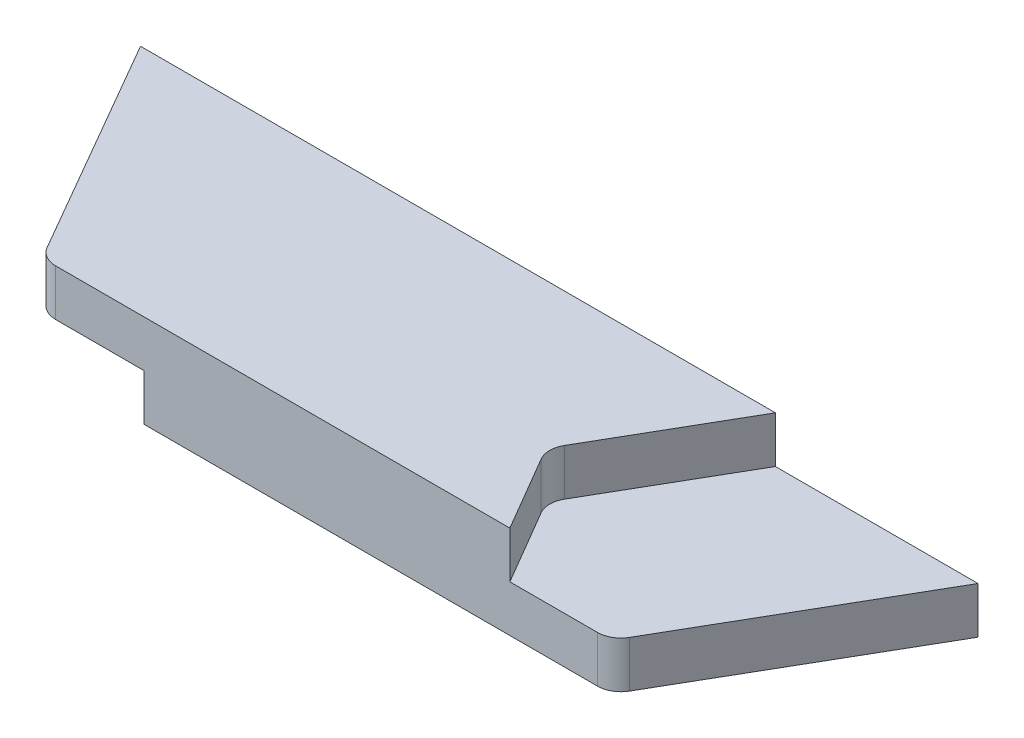
ISO-10303-21;
HEADER;
FILE_DESCRIPTION(('STEP AP214'),'2;1');
FILE_NAME('part.step','',(''),(''),'','','');
FILE_SCHEMA(('AUTOMOTIVE_DESIGN { 1 0 10303 214 1 1 1 1 }'));
ENDSEC;
DATA;
#1=APPLICATION_CONTEXT('core data for automotive mechanical design processes');
#2=APPLICATION_PROTOCOL_DEFINITION('international standard','automotive_design',2000,#1);
#3=PRODUCT_CONTEXT('',#1,'mechanical');
#4=PRODUCT('Part','Part','',(#3));
#5=PRODUCT_RELATED_PRODUCT_CATEGORY('part','',(#4));
#6=PRODUCT_DEFINITION_FORMATION('','',#4);
#7=PRODUCT_DEFINITION_CONTEXT('part definition',#1,'design');
#8=PRODUCT_DEFINITION('design','',#6,#7);
#9=PRODUCT_DEFINITION_SHAPE('','',#8);
#10=(LENGTH_UNIT() NAMED_UNIT(*) SI_UNIT(.MILLI.,.METRE.));
#11=(NAMED_UNIT(*) PLANE_ANGLE_UNIT() SI_UNIT($,.RADIAN.));
#12=(NAMED_UNIT(*) SI_UNIT($,.STERADIAN.) SOLID_ANGLE_UNIT());
#13=UNCERTAINTY_MEASURE_WITH_UNIT(LENGTH_MEASURE(1.E-05),#10,'distance_accuracy_value','');
#14=(GEOMETRIC_REPRESENTATION_CONTEXT(3) GLOBAL_UNCERTAINTY_ASSIGNED_CONTEXT((#13)) GLOBAL_UNIT_ASSIGNED_CONTEXT((#10,
#11,#12)) REPRESENTATION_CONTEXT('',''));
#15=CARTESIAN_POINT('',(0.,0.,0.));
#16=DIRECTION('',(0.,0.,1.));
#17=DIRECTION('',(1.,0.,0.));
#18=AXIS2_PLACEMENT_3D('',#15,#16,#17);
#19=CARTESIAN_POINT('',(180.,0.,0.));
#20=DIRECTION('',(0.,0.,-1.));
#21=DIRECTION('',(-1.,0.,0.));
#22=AXIS2_PLACEMENT_3D('',#19,#20,#21);
#23=PLANE('',#22);
#24=DIRECTION('',(-1.,0.,0.));
#25=VECTOR('',#24,1.);
#26=CARTESIAN_POINT('',(180.,0.,0.));
#27=LINE('',#26,#25);
#28=CARTESIAN_POINT('',(148.24573519457,0.,0.));
#29=VERTEX_POINT('',#28);
#30=CARTESIAN_POINT('',(50.6989823595867,0.,0.));
#31=VERTEX_POINT('',#30);
#32=EDGE_CURVE('E137',#29,#31,#27,.T.);
#33=ORIENTED_EDGE('',*,*,#32,.F.);
#34=DIRECTION('',(0.,1.,0.));
#35=VECTOR('',#34,1.);
#36=CARTESIAN_POINT('',(148.24573519457,0.,0.));
#37=LINE('',#36,#35);
#38=CARTESIAN_POINT('',(148.24573519457,10.,0.));
#39=VERTEX_POINT('',#38);
#40=EDGE_CURVE('E162',#29,#39,#37,.T.);
#41=ORIENTED_EDGE('',*,*,#40,.T.);
#42=DIRECTION('',(1.,0.,0.));
#43=VECTOR('',#42,1.);
#44=CARTESIAN_POINT('',(180.,10.,0.));
#45=LINE('',#44,#43);
#46=CARTESIAN_POINT('',(129.384239063704,10.,0.));
#47=VERTEX_POINT('',#46);
#48=EDGE_CURVE('E157',#47,#39,#45,.T.);
#49=ORIENTED_EDGE('',*,*,#48,.F.);
#50=DIRECTION('',(0.,1.,0.));
#51=VECTOR('',#50,1.);
#52=CARTESIAN_POINT('',(129.384239063704,10.,0.));
#53=LINE('',#52,#51);
#54=CARTESIAN_POINT('',(129.384239063704,20.,0.));
#55=VERTEX_POINT('',#54);
#56=EDGE_CURVE('E195',#47,#55,#53,.T.);
#57=ORIENTED_EDGE('',*,*,#56,.T.);
#58=DIRECTION('',(-1.,0.,0.));
#59=VECTOR('',#58,1.);
#60=CARTESIAN_POINT('',(180.,20.,0.));
#61=LINE('',#60,#59);
#62=CARTESIAN_POINT('',(31.7542648054294,20.,0.));
#63=VERTEX_POINT('',#62);
#64=EDGE_CURVE('E128',#55,#63,#61,.T.);
#65=ORIENTED_EDGE('',*,*,#64,.T.);
#66=DIRECTION('',(0.,1.,0.));
#67=VECTOR('',#66,1.);
#68=CARTESIAN_POINT('',(31.7542648054294,0.,0.));
#69=LINE('',#68,#67);
#70=CARTESIAN_POINT('',(31.7542648054294,10.,0.));
#71=VERTEX_POINT('',#70);
#72=EDGE_CURVE('E171',#71,#63,#69,.T.);
#73=ORIENTED_EDGE('',*,*,#72,.F.);
#74=DIRECTION('',(-1.,0.,0.));
#75=VECTOR('',#74,1.);
#76=CARTESIAN_POINT('',(0.,10.,0.));
#77=LINE('',#76,#75);
#78=CARTESIAN_POINT('',(50.6989823595867,10.,0.));
#79=VERTEX_POINT('',#78);
#80=EDGE_CURVE('E112',#79,#71,#77,.T.);
#81=ORIENTED_EDGE('',*,*,#80,.F.);
#82=DIRECTION('',(0.,-1.,0.));
#83=VECTOR('',#82,1.);
#84=CARTESIAN_POINT('',(50.6989823595867,10.,0.));
#85=LINE('',#84,#83);
#86=EDGE_CURVE('E82',#79,#31,#85,.T.);
#87=ORIENTED_EDGE('',*,*,#86,.T.);
#88=EDGE_LOOP('',(#33,#41,#49,#57,#65,#73,#81,#87));
#89=FACE_BOUND('',#88,.T.);
#90=ADVANCED_FACE('F35',(#89),#23,.F.);
#91=CARTESIAN_POINT('',(180.,0.,0.));
#92=DIRECTION('',(0.,1.,0.));
#93=DIRECTION('',(0.,0.,1.));
#94=AXIS2_PLACEMENT_3D('',#91,#92,#93);
#95=PLANE('',#94);
#96=DIRECTION('',(0.500000000000004,0.,-0.866025403784436));
#97=VECTOR('',#96,1.);
#98=CARTESIAN_POINT('',(180.,0.,-50.));
#99=LINE('',#98,#97);
#100=CARTESIAN_POINT('',(152.575862213492,0.,-2.49999999999999));
#101=VERTEX_POINT('',#100);
#102=CARTESIAN_POINT('',(180.,0.,-50.));
#103=VERTEX_POINT('',#102);
#104=EDGE_CURVE('E182',#101,#103,#99,.T.);
#105=ORIENTED_EDGE('',*,*,#104,.F.);
#106=CARTESIAN_POINT('',(148.24573519457,0.,-4.99999999999999));
#107=DIRECTION('',(0.,1.,0.));
#108=DIRECTION('',(0.,0.,-1.));
#109=AXIS2_PLACEMENT_3D('',#106,#107,#108);
#110=CIRCLE('',#109,4.99999999999998);
#111=EDGE_CURVE('E281',#29,#101,#110,.T.);
#112=ORIENTED_EDGE('',*,*,#111,.F.);
#113=ORIENTED_EDGE('',*,*,#32,.T.);
#114=DIRECTION('',(-0.498957385164401,0.,0.866626521513105));
#115=VECTOR('',#114,1.);
#116=CARTESIAN_POINT('',(50.6989823595867,0.,0.));
#117=LINE('',#116,#115);
#118=CARTESIAN_POINT('',(60.0885681456715,0.,-16.3085351779339));
#119=VERTEX_POINT('',#118);
#120=EDGE_CURVE('E206',#119,#31,#117,.T.);
#121=ORIENTED_EDGE('',*,*,#120,.F.);
#122=CARTESIAN_POINT('',(55.755435538106,0.,-18.8033221037559));
#123=DIRECTION('',(0.,-1.,0.));
#124=DIRECTION('',(0.,0.,-1.));
#125=AXIS2_PLACEMENT_3D('',#122,#123,#124);
#126=CIRCLE('',#125,5.);
#127=CARTESIAN_POINT('',(60.0855625570282,0.,-21.3033221037559));
#128=VERTEX_POINT('',#127);
#129=EDGE_CURVE('E216',#128,#119,#126,.T.);
#130=ORIENTED_EDGE('',*,*,#129,.F.);
#131=DIRECTION('',(0.5,0.,0.866025403784438));
#132=VECTOR('',#131,1.);
#133=CARTESIAN_POINT('',(60.0855625570282,0.,-21.3033221037559));
#134=LINE('',#133,#132);
#135=CARTESIAN_POINT('',(43.5175278487837,0.,-50.));
#136=VERTEX_POINT('',#135);
#137=EDGE_CURVE('E220',#136,#128,#134,.T.);
#138=ORIENTED_EDGE('',*,*,#137,.F.);
#139=DIRECTION('',(-1.,0.,0.));
#140=VECTOR('',#139,1.);
#141=CARTESIAN_POINT('',(180.,0.,-50.));
#142=LINE('',#141,#140);
#143=EDGE_CURVE('E119',#103,#136,#142,.T.);
#144=ORIENTED_EDGE('',*,*,#143,.F.);
#145=EDGE_LOOP('',(#105,#112,#113,#121,#130,#138,#144));
#146=FACE_BOUND('',#145,.T.);
#147=ADVANCED_FACE('F227',(#146),#95,.F.);
#148=CARTESIAN_POINT('',(180.,20.,0.));
#149=DIRECTION('',(0.,-1.,0.));
#150=DIRECTION('',(0.,0.,-1.));
#151=AXIS2_PLACEMENT_3D('',#148,#149,#150);
#152=PLANE('',#151);
#153=CARTESIAN_POINT('',(31.7542648054294,20.,-5.));
#154=DIRECTION('',(0.,1.,0.));
#155=DIRECTION('',(0.,0.,-1.));
#156=AXIS2_PLACEMENT_3D('',#153,#154,#155);
#157=CIRCLE('',#156,5.);
#158=CARTESIAN_POINT('',(27.4241377865072,20.,-2.5));
#159=VERTEX_POINT('',#158);
#160=EDGE_CURVE('E270',#159,#63,#157,.T.);
#161=ORIENTED_EDGE('',*,*,#160,.T.);
#162=ORIENTED_EDGE('',*,*,#64,.F.);
#163=DIRECTION('',(0.505016090605679,0.,0.863109928241679));
#164=VECTOR('',#163,1.);
#165=CARTESIAN_POINT('',(119.884637949288,20.,-16.2355223699002));
#166=LINE('',#165,#164);
#167=CARTESIAN_POINT('',(119.884637949288,20.,-16.2355223699002));
#168=VERTEX_POINT('',#167);
#169=EDGE_CURVE('E173',#168,#55,#166,.T.);
#170=ORIENTED_EDGE('',*,*,#169,.F.);
#171=CARTESIAN_POINT('',(124.200187590497,20.,-18.7606028229286));
#172=DIRECTION('',(0.,1.,0.));
#173=DIRECTION('',(0.,0.,-1.));
#174=AXIS2_PLACEMENT_3D('',#171,#172,#173);
#175=CIRCLE('',#174,4.99999999999999);
#176=CARTESIAN_POINT('',(119.870060571575,20.,-21.2606028229286));
#177=VERTEX_POINT('',#176);
#178=EDGE_CURVE('E185',#177,#168,#175,.T.);
#179=ORIENTED_EDGE('',*,*,#178,.F.);
#180=DIRECTION('',(-0.5,0.,0.866025403784438));
#181=VECTOR('',#180,1.);
#182=CARTESIAN_POINT('',(119.870060571575,20.,-21.2606028229286));
#183=LINE('',#182,#181);
#184=CARTESIAN_POINT('',(136.462759268104,20.,-50.));
#185=VERTEX_POINT('',#184);
#186=EDGE_CURVE('E198',#185,#177,#183,.T.);
#187=ORIENTED_EDGE('',*,*,#186,.F.);
#188=DIRECTION('',(-1.,0.,0.));
#189=VECTOR('',#188,1.);
#190=CARTESIAN_POINT('',(180.,20.,-50.));
#191=LINE('',#190,#189);
#192=CARTESIAN_POINT('',(0.,20.,-50.));
#193=VERTEX_POINT('',#192);
#194=EDGE_CURVE('E133',#185,#193,#191,.T.);
#195=ORIENTED_EDGE('',*,*,#194,.T.);
#196=DIRECTION('',(0.5,0.,0.866025403784438));
#197=VECTOR('',#196,1.);
#198=CARTESIAN_POINT('',(27.4241377865072,20.,-2.5));
#199=LINE('',#198,#197);
#200=EDGE_CURVE('E279',#193,#159,#199,.T.);
#201=ORIENTED_EDGE('',*,*,#200,.T.);
#202=EDGE_LOOP('',(#161,#162,#170,#179,#187,#195,#201));
#203=FACE_BOUND('',#202,.T.);
#204=ADVANCED_FACE('F266',(#203),#152,.F.);
#205=CARTESIAN_POINT('',(55.755435538106,10.,-18.8033221037559));
#206=DIRECTION('',(0.,-1.,0.));
#207=DIRECTION('',(0.,0.,-1.));
#208=AXIS2_PLACEMENT_3D('',#205,#206,#207);
#209=PLANE('',#208);
#210=ORIENTED_EDGE('',*,*,#80,.T.);
#211=CARTESIAN_POINT('',(31.7542648054294,10.,-5.));
#212=DIRECTION('',(0.,-1.,0.));
#213=DIRECTION('',(0.,0.,-1.));
#214=AXIS2_PLACEMENT_3D('',#211,#212,#213);
#215=CIRCLE('',#214,5.);
#216=CARTESIAN_POINT('',(27.4241377865072,10.,-2.5));
#217=VERTEX_POINT('',#216);
#218=EDGE_CURVE('E12',#71,#217,#215,.T.);
#219=ORIENTED_EDGE('',*,*,#218,.T.);
#220=DIRECTION('',(-0.5,0.,-0.866025403784439));
#221=VECTOR('',#220,1.);
#222=CARTESIAN_POINT('',(27.4474166704404,10.,-2.45967979028418));
#223=LINE('',#222,#221);
#224=CARTESIAN_POINT('',(0.,10.,-50.));
#225=VERTEX_POINT('',#224);
#226=EDGE_CURVE('E42',#217,#225,#223,.T.);
#227=ORIENTED_EDGE('',*,*,#226,.T.);
#228=DIRECTION('',(1.,0.,0.));
#229=VECTOR('',#228,1.);
#230=CARTESIAN_POINT('',(43.5175278487837,10.,-50.));
#231=LINE('',#230,#229);
#232=CARTESIAN_POINT('',(43.5175278487837,10.,-50.));
#233=VERTEX_POINT('',#232);
#234=EDGE_CURVE('E103',#225,#233,#231,.T.);
#235=ORIENTED_EDGE('',*,*,#234,.T.);
#236=DIRECTION('',(0.5,0.,0.866025403784438));
#237=VECTOR('',#236,1.);
#238=CARTESIAN_POINT('',(60.0855625570282,10.,-21.3033221037559));
#239=LINE('',#238,#237);
#240=CARTESIAN_POINT('',(60.0855625570282,10.,-21.3033221037559));
#241=VERTEX_POINT('',#240);
#242=EDGE_CURVE('E92',#233,#241,#239,.T.);
#243=ORIENTED_EDGE('',*,*,#242,.T.);
#244=CARTESIAN_POINT('',(55.755435538106,10.,-18.8033221037559));
#245=DIRECTION('',(0.,-1.,0.));
#246=DIRECTION('',(0.,0.,-1.));
#247=AXIS2_PLACEMENT_3D('',#244,#245,#246);
#248=CIRCLE('',#247,5.);
#249=CARTESIAN_POINT('',(60.0885681456715,10.,-16.3085351779339));
#250=VERTEX_POINT('',#249);
#251=EDGE_CURVE('E102',#241,#250,#248,.T.);
#252=ORIENTED_EDGE('',*,*,#251,.T.);
#253=DIRECTION('',(-0.498957385164401,0.,0.866626521513105));
#254=VECTOR('',#253,1.);
#255=CARTESIAN_POINT('',(50.6989823595867,10.,0.));
#256=LINE('',#255,#254);
#257=EDGE_CURVE('E214',#250,#79,#256,.T.);
#258=ORIENTED_EDGE('',*,*,#257,.T.);
#259=EDGE_LOOP('',(#210,#219,#227,#235,#243,#252,#258));
#260=FACE_BOUND('',#259,.T.);
#261=ADVANCED_FACE('F108',(#260),#209,.T.);
#262=CARTESIAN_POINT('',(124.200187590497,10.,-18.7606028229286));
#263=DIRECTION('',(0.,-1.,0.));
#264=DIRECTION('',(0.,0.,-1.));
#265=AXIS2_PLACEMENT_3D('',#262,#263,#264);
#266=PLANE('',#265);
#267=DIRECTION('',(-0.500000000000004,0.,0.866025403784436));
#268=VECTOR('',#267,1.);
#269=CARTESIAN_POINT('',(152.522991120496,10.,-2.40842458067841));
#270=LINE('',#269,#268);
#271=CARTESIAN_POINT('',(180.,10.,-50.));
#272=VERTEX_POINT('',#271);
#273=CARTESIAN_POINT('',(152.575862213492,10.,-2.49999999999999));
#274=VERTEX_POINT('',#273);
#275=EDGE_CURVE('E141',#272,#274,#270,.T.);
#276=ORIENTED_EDGE('',*,*,#275,.F.);
#277=DIRECTION('',(-1.,0.,0.));
#278=VECTOR('',#277,1.);
#279=CARTESIAN_POINT('',(136.462759268104,10.,-50.));
#280=LINE('',#279,#278);
#281=CARTESIAN_POINT('',(136.462759268104,10.,-50.));
#282=VERTEX_POINT('',#281);
#283=EDGE_CURVE('E187',#272,#282,#280,.T.);
#284=ORIENTED_EDGE('',*,*,#283,.T.);
#285=DIRECTION('',(-0.5,0.,0.866025403784438));
#286=VECTOR('',#285,1.);
#287=CARTESIAN_POINT('',(119.870060571575,10.,-21.2606028229286));
#288=LINE('',#287,#286);
#289=CARTESIAN_POINT('',(119.870060571575,10.,-21.2606028229286));
#290=VERTEX_POINT('',#289);
#291=EDGE_CURVE('E189',#282,#290,#288,.T.);
#292=ORIENTED_EDGE('',*,*,#291,.T.);
#293=CARTESIAN_POINT('',(124.200187590497,10.,-18.7606028229286));
#294=DIRECTION('',(0.,1.,0.));
#295=DIRECTION('',(0.,0.,-1.));
#296=AXIS2_PLACEMENT_3D('',#293,#294,#295);
#297=CIRCLE('',#296,4.99999999999999);
#298=CARTESIAN_POINT('',(119.884637949288,10.,-16.2355223699002));
#299=VERTEX_POINT('',#298);
#300=EDGE_CURVE('E192',#290,#299,#297,.T.);
#301=ORIENTED_EDGE('',*,*,#300,.T.);
#302=DIRECTION('',(0.505016090605679,0.,0.863109928241679));
#303=VECTOR('',#302,1.);
#304=CARTESIAN_POINT('',(119.884637949288,10.,-16.2355223699002));
#305=LINE('',#304,#303);
#306=EDGE_CURVE('E183',#299,#47,#305,.T.);
#307=ORIENTED_EDGE('',*,*,#306,.T.);
#308=ORIENTED_EDGE('',*,*,#48,.T.);
#309=CARTESIAN_POINT('',(148.24573519457,10.,-4.99999999999999));
#310=DIRECTION('',(0.,-1.,0.));
#311=DIRECTION('',(0.,0.,-1.));
#312=AXIS2_PLACEMENT_3D('',#309,#310,#311);
#313=CIRCLE('',#312,4.99999999999998);
#314=EDGE_CURVE('E139',#274,#39,#313,.T.);
#315=ORIENTED_EDGE('',*,*,#314,.F.);
#316=EDGE_LOOP('',(#276,#284,#292,#301,#307,#308,#315));
#317=FACE_BOUND('',#316,.T.);
#318=ADVANCED_FACE('F153',(#317),#266,.F.);
#319=CARTESIAN_POINT('',(180.,0.,-50.));
#320=DIRECTION('',(0.,0.,1.));
#321=DIRECTION('',(1.,0.,0.));
#322=AXIS2_PLACEMENT_3D('',#319,#320,#321);
#323=PLANE('',#322);
#324=ORIENTED_EDGE('',*,*,#194,.F.);
#325=DIRECTION('',(0.,1.,0.));
#326=VECTOR('',#325,1.);
#327=CARTESIAN_POINT('',(136.462759268104,10.,-50.));
#328=LINE('',#327,#326);
#329=EDGE_CURVE('E210',#282,#185,#328,.T.);
#330=ORIENTED_EDGE('',*,*,#329,.F.);
#331=ORIENTED_EDGE('',*,*,#283,.F.);
#332=DIRECTION('',(0.,1.,0.));
#333=VECTOR('',#332,1.);
#334=CARTESIAN_POINT('',(180.,0.,-50.));
#335=LINE('',#334,#333);
#336=EDGE_CURVE('E125',#103,#272,#335,.T.);
#337=ORIENTED_EDGE('',*,*,#336,.F.);
#338=ORIENTED_EDGE('',*,*,#143,.T.);
#339=DIRECTION('',(0.,-1.,0.));
#340=VECTOR('',#339,1.);
#341=CARTESIAN_POINT('',(43.5175278487837,10.,-50.));
#342=LINE('',#341,#340);
#343=EDGE_CURVE('E97',#233,#136,#342,.T.);
#344=ORIENTED_EDGE('',*,*,#343,.F.);
#345=ORIENTED_EDGE('',*,*,#234,.F.);
#346=DIRECTION('',(0.,1.,0.));
#347=VECTOR('',#346,1.);
#348=CARTESIAN_POINT('',(0.,0.,-50.));
#349=LINE('',#348,#347);
#350=EDGE_CURVE('E129',#225,#193,#349,.T.);
#351=ORIENTED_EDGE('',*,*,#350,.T.);
#352=EDGE_LOOP('',(#324,#330,#331,#337,#338,#344,#345,#351));
#353=FACE_BOUND('',#352,.T.);
#354=ADVANCED_FACE('F116',(#353),#323,.F.);
#355=CARTESIAN_POINT('',(50.6989823595867,10.,0.));
#356=DIRECTION('',(0.866626521513105,0.,0.498957385164401));
#357=DIRECTION('',(0.498957385164401,0.,-0.866626521513105));
#358=AXIS2_PLACEMENT_3D('',#355,#356,#357);
#359=PLANE('',#358);
#360=ORIENTED_EDGE('',*,*,#120,.T.);
#361=ORIENTED_EDGE('',*,*,#86,.F.);
#362=ORIENTED_EDGE('',*,*,#257,.F.);
#363=DIRECTION('',(0.,-1.,0.));
#364=VECTOR('',#363,1.);
#365=CARTESIAN_POINT('',(60.0885681456715,10.,-16.3085351779339));
#366=LINE('',#365,#364);
#367=EDGE_CURVE('E58',#250,#119,#366,.T.);
#368=ORIENTED_EDGE('',*,*,#367,.T.);
#369=EDGE_LOOP('',(#360,#361,#362,#368));
#370=FACE_BOUND('',#369,.T.);
#371=ADVANCED_FACE('F228',(#370),#359,.F.);
#372=CARTESIAN_POINT('',(55.755435538106,10.,-18.8033221037559));
#373=DIRECTION('',(0.,-1.,0.));
#374=DIRECTION('',(0.,0.,-1.));
#375=AXIS2_PLACEMENT_3D('',#372,#373,#374);
#376=CYLINDRICAL_SURFACE('',#375,5.);
#377=ORIENTED_EDGE('',*,*,#129,.T.);
#378=ORIENTED_EDGE('',*,*,#367,.F.);
#379=ORIENTED_EDGE('',*,*,#251,.F.);
#380=DIRECTION('',(0.,-1.,0.));
#381=VECTOR('',#380,1.);
#382=CARTESIAN_POINT('',(60.0855625570282,10.,-21.3033221037559));
#383=LINE('',#382,#381);
#384=EDGE_CURVE('E99',#241,#128,#383,.T.);
#385=ORIENTED_EDGE('',*,*,#384,.T.);
#386=EDGE_LOOP('',(#377,#378,#379,#385));
#387=FACE_BOUND('',#386,.T.);
#388=ADVANCED_FACE('F224',(#387),#376,.F.);
#389=CARTESIAN_POINT('',(60.0855625570282,10.,-21.3033221037559));
#390=DIRECTION('',(0.866025403784438,0.,-0.5));
#391=DIRECTION('',(-0.5,0.,-0.866025403784439));
#392=AXIS2_PLACEMENT_3D('',#389,#390,#391);
#393=PLANE('',#392);
#394=ORIENTED_EDGE('',*,*,#137,.T.);
#395=ORIENTED_EDGE('',*,*,#384,.F.);
#396=ORIENTED_EDGE('',*,*,#242,.F.);
#397=ORIENTED_EDGE('',*,*,#343,.T.);
#398=EDGE_LOOP('',(#394,#395,#396,#397));
#399=FACE_BOUND('',#398,.T.);
#400=ADVANCED_FACE('F95',(#399),#393,.F.);
#401=CARTESIAN_POINT('',(119.884637949288,10.,-16.2355223699002));
#402=DIRECTION('',(-0.863109928241679,0.,0.505016090605679));
#403=DIRECTION('',(0.505016090605679,0.,0.863109928241679));
#404=AXIS2_PLACEMENT_3D('',#401,#402,#403);
#405=PLANE('',#404);
#406=ORIENTED_EDGE('',*,*,#169,.T.);
#407=ORIENTED_EDGE('',*,*,#56,.F.);
#408=ORIENTED_EDGE('',*,*,#306,.F.);
#409=DIRECTION('',(0.,1.,0.));
#410=VECTOR('',#409,1.);
#411=CARTESIAN_POINT('',(119.884637949288,10.,-16.2355223699002));
#412=LINE('',#411,#410);
#413=EDGE_CURVE('E203',#299,#168,#412,.T.);
#414=ORIENTED_EDGE('',*,*,#413,.T.);
#415=EDGE_LOOP('',(#406,#407,#408,#414));
#416=FACE_BOUND('',#415,.T.);
#417=ADVANCED_FACE('F258',(#416),#405,.F.);
#418=CARTESIAN_POINT('',(124.200187590497,10.,-18.7606028229286));
#419=DIRECTION('',(0.,1.,0.));
#420=DIRECTION('',(0.,0.,1.));
#421=AXIS2_PLACEMENT_3D('',#418,#419,#420);
#422=CYLINDRICAL_SURFACE('',#421,4.99999999999999);
#423=ORIENTED_EDGE('',*,*,#178,.T.);
#424=ORIENTED_EDGE('',*,*,#413,.F.);
#425=ORIENTED_EDGE('',*,*,#300,.F.);
#426=DIRECTION('',(0.,1.,0.));
#427=VECTOR('',#426,1.);
#428=CARTESIAN_POINT('',(119.870060571575,10.,-21.2606028229286));
#429=LINE('',#428,#427);
#430=EDGE_CURVE('E207',#290,#177,#429,.T.);
#431=ORIENTED_EDGE('',*,*,#430,.T.);
#432=EDGE_LOOP('',(#423,#424,#425,#431));
#433=FACE_BOUND('',#432,.T.);
#434=ADVANCED_FACE('F261',(#433),#422,.F.);
#435=CARTESIAN_POINT('',(119.870060571575,10.,-21.2606028229286));
#436=DIRECTION('',(-0.866025403784438,0.,-0.5));
#437=DIRECTION('',(-0.5,0.,0.866025403784439));
#438=AXIS2_PLACEMENT_3D('',#435,#436,#437);
#439=PLANE('',#438);
#440=ORIENTED_EDGE('',*,*,#186,.T.);
#441=ORIENTED_EDGE('',*,*,#430,.F.);
#442=ORIENTED_EDGE('',*,*,#291,.F.);
#443=ORIENTED_EDGE('',*,*,#329,.T.);
#444=EDGE_LOOP('',(#440,#441,#442,#443));
#445=FACE_BOUND('',#444,.T.);
#446=ADVANCED_FACE('F285',(#445),#439,.F.);
#447=CARTESIAN_POINT('',(148.24573519457,0.,-4.99999999999999));
#448=DIRECTION('',(0.,1.,0.));
#449=DIRECTION('',(0.,0.,1.));
#450=AXIS2_PLACEMENT_3D('',#447,#448,#449);
#451=CYLINDRICAL_SURFACE('',#450,4.99999999999998);
#452=ORIENTED_EDGE('',*,*,#314,.T.);
#453=ORIENTED_EDGE('',*,*,#40,.F.);
#454=ORIENTED_EDGE('',*,*,#111,.T.);
#455=DIRECTION('',(0.,1.,0.));
#456=VECTOR('',#455,1.);
#457=CARTESIAN_POINT('',(152.575862213492,0.,-2.49999999999999));
#458=LINE('',#457,#456);
#459=EDGE_CURVE('E49',#101,#274,#458,.T.);
#460=ORIENTED_EDGE('',*,*,#459,.T.);
#461=EDGE_LOOP('',(#452,#453,#454,#460));
#462=FACE_BOUND('',#461,.T.);
#463=ADVANCED_FACE('F160',(#462),#451,.T.);
#464=CARTESIAN_POINT('',(180.,0.,-50.));
#465=DIRECTION('',(0.866025403784436,0.,0.500000000000004));
#466=DIRECTION('',(0.500000000000004,0.,-0.866025403784436));
#467=AXIS2_PLACEMENT_3D('',#464,#465,#466);
#468=PLANE('',#467);
#469=ORIENTED_EDGE('',*,*,#275,.T.);
#470=ORIENTED_EDGE('',*,*,#459,.F.);
#471=ORIENTED_EDGE('',*,*,#104,.T.);
#472=ORIENTED_EDGE('',*,*,#336,.T.);
#473=EDGE_LOOP('',(#469,#470,#471,#472));
#474=FACE_BOUND('',#473,.T.);
#475=ADVANCED_FACE('F145',(#474),#468,.T.);
#476=CARTESIAN_POINT('',(31.7542648054294,0.,-5.));
#477=DIRECTION('',(0.,1.,0.));
#478=DIRECTION('',(0.,0.,1.));
#479=AXIS2_PLACEMENT_3D('',#476,#477,#478);
#480=CYLINDRICAL_SURFACE('',#479,5.);
#481=ORIENTED_EDGE('',*,*,#72,.T.);
#482=ORIENTED_EDGE('',*,*,#160,.F.);
#483=DIRECTION('',(0.,1.,0.));
#484=VECTOR('',#483,1.);
#485=CARTESIAN_POINT('',(27.4241377865072,0.,-2.5));
#486=LINE('',#485,#484);
#487=EDGE_CURVE('E176',#217,#159,#486,.T.);
#488=ORIENTED_EDGE('',*,*,#487,.F.);
#489=ORIENTED_EDGE('',*,*,#218,.F.);
#490=EDGE_LOOP('',(#481,#482,#488,#489));
#491=FACE_BOUND('',#490,.T.);
#492=ADVANCED_FACE('F287',(#491),#480,.T.);
#493=CARTESIAN_POINT('',(27.4241377865072,0.,-2.5));
#494=DIRECTION('',(-0.866025403784439,0.,0.5));
#495=DIRECTION('',(0.5,0.,0.866025403784439));
#496=AXIS2_PLACEMENT_3D('',#493,#494,#495);
#497=PLANE('',#496);
#498=ORIENTED_EDGE('',*,*,#487,.T.);
#499=ORIENTED_EDGE('',*,*,#200,.F.);
#500=ORIENTED_EDGE('',*,*,#350,.F.);
#501=ORIENTED_EDGE('',*,*,#226,.F.);
#502=EDGE_LOOP('',(#498,#499,#500,#501));
#503=FACE_BOUND('',#502,.T.);
#504=ADVANCED_FACE('F286',(#503),#497,.T.);
#505=CLOSED_SHELL('',(#90,#147,#204,#261,#318,#354,#371,#388,#400,#417,#434,#446,#463,#475,#492,#504));
#506=MANIFOLD_SOLID_BREP('B2',#505);
#507=ADVANCED_BREP_SHAPE_REPRESENTATION('',(#18,#506),#14);
#508=SHAPE_DEFINITION_REPRESENTATION(#9,#507);
ENDSEC;
END-ISO-10303-21;
